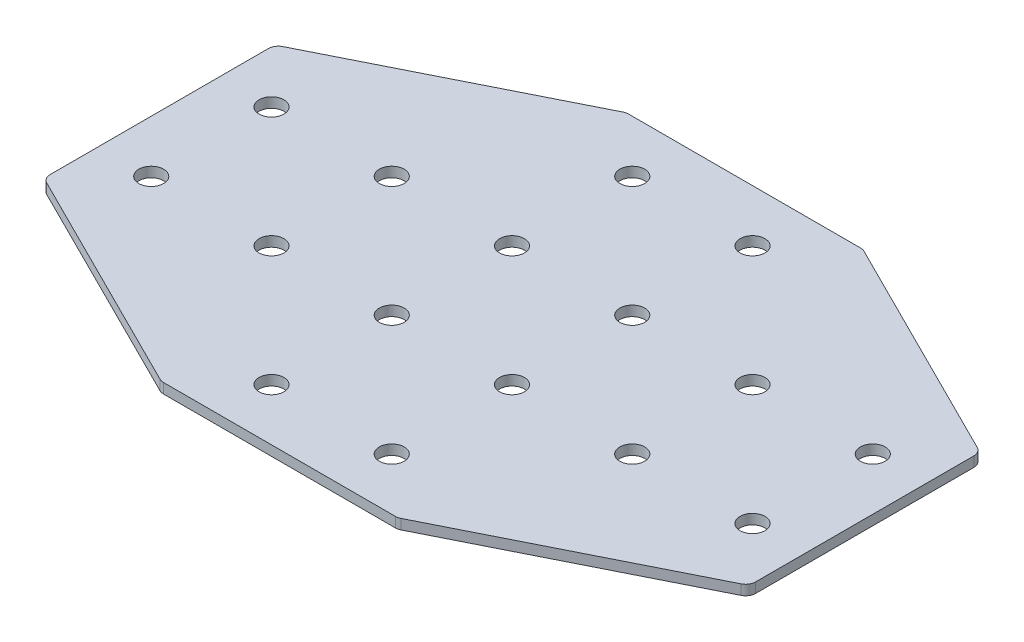
ISO-10303-21;
HEADER;
FILE_DESCRIPTION(('STEP AP214'),'2;1');
FILE_NAME('part.step','',(''),(''),'','','');
FILE_SCHEMA(('AUTOMOTIVE_DESIGN { 1 0 10303 214 1 1 1 1 }'));
ENDSEC;
DATA;
#1=APPLICATION_CONTEXT('core data for automotive mechanical design processes');
#2=APPLICATION_PROTOCOL_DEFINITION('international standard','automotive_design',2000,#1);
#3=PRODUCT_CONTEXT('',#1,'mechanical');
#4=PRODUCT('Part','Part','',(#3));
#5=PRODUCT_RELATED_PRODUCT_CATEGORY('part','',(#4));
#6=PRODUCT_DEFINITION_FORMATION('','',#4);
#7=PRODUCT_DEFINITION_CONTEXT('part definition',#1,'design');
#8=PRODUCT_DEFINITION('design','',#6,#7);
#9=PRODUCT_DEFINITION_SHAPE('','',#8);
#10=(LENGTH_UNIT() NAMED_UNIT(*) SI_UNIT(.MILLI.,.METRE.));
#11=(NAMED_UNIT(*) PLANE_ANGLE_UNIT() SI_UNIT($,.RADIAN.));
#12=(NAMED_UNIT(*) SI_UNIT($,.STERADIAN.) SOLID_ANGLE_UNIT());
#13=UNCERTAINTY_MEASURE_WITH_UNIT(LENGTH_MEASURE(1.E-05),#10,'distance_accuracy_value','');
#14=(GEOMETRIC_REPRESENTATION_CONTEXT(3) GLOBAL_UNCERTAINTY_ASSIGNED_CONTEXT((#13)) GLOBAL_UNIT_ASSIGNED_CONTEXT((#10,
#11,#12)) REPRESENTATION_CONTEXT('',''));
#15=CARTESIAN_POINT('',(0.,0.,0.));
#16=DIRECTION('',(0.,0.,1.));
#17=DIRECTION('',(1.,0.,0.));
#18=AXIS2_PLACEMENT_3D('',#15,#16,#17);
#19=CARTESIAN_POINT('',(-1.3162117550678,0.80807034319605,-0.741524121224302));
#20=DIRECTION('',(0.,-1.,0.));
#21=DIRECTION('',(0.,0.,-1.));
#22=AXIS2_PLACEMENT_3D('',#19,#20,#21);
#23=PLANE('',#22);
#24=CARTESIAN_POINT('',(-16.3162117550678,0.80807034319605,14.2584758787757));
#25=DIRECTION('',(0.,-1.,0.));
#26=DIRECTION('',(0.,0.,1.));
#27=AXIS2_PLACEMENT_3D('',#24,#25,#26);
#28=CIRCLE('',#27,3.1);
#29=CARTESIAN_POINT('',(-16.3162117550678,0.80807034319605,17.3584758787757));
#30=VERTEX_POINT('',#29);
#31=EDGE_CURVE('E140',#30,#30,#28,.T.);
#32=ORIENTED_EDGE('',*,*,#31,.F.);
#33=EDGE_LOOP('',(#32));
#34=FACE_BOUND('',#33,.T.);
#35=CARTESIAN_POINT('',(-16.3162117550678,0.80807034319605,44.2584758787757));
#36=DIRECTION('',(0.,-1.,0.));
#37=DIRECTION('',(0.,0.,1.));
#38=AXIS2_PLACEMENT_3D('',#35,#36,#37);
#39=CIRCLE('',#38,3.1);
#40=CARTESIAN_POINT('',(-16.3162117550678,0.80807034319605,47.3584758787757));
#41=VERTEX_POINT('',#40);
#42=EDGE_CURVE('E243',#41,#41,#39,.T.);
#43=ORIENTED_EDGE('',*,*,#42,.F.);
#44=EDGE_LOOP('',(#43));
#45=FACE_BOUND('',#44,.T.);
#46=CARTESIAN_POINT('',(-46.3162117550678,0.80807034319605,14.2584758787757));
#47=DIRECTION('',(0.,-1.,0.));
#48=DIRECTION('',(0.,0.,1.));
#49=AXIS2_PLACEMENT_3D('',#46,#47,#48);
#50=CIRCLE('',#49,3.1);
#51=CARTESIAN_POINT('',(-46.3162117550678,0.80807034319605,17.3584758787757));
#52=VERTEX_POINT('',#51);
#53=EDGE_CURVE('E237',#52,#52,#50,.T.);
#54=ORIENTED_EDGE('',*,*,#53,.F.);
#55=EDGE_LOOP('',(#54));
#56=FACE_BOUND('',#55,.T.);
#57=CARTESIAN_POINT('',(-76.3162117550678,0.80807034319605,14.2584758787757));
#58=DIRECTION('',(0.,-1.,0.));
#59=DIRECTION('',(0.,0.,1.));
#60=AXIS2_PLACEMENT_3D('',#57,#58,#59);
#61=CIRCLE('',#60,3.1);
#62=CARTESIAN_POINT('',(-76.3162117550678,0.80807034319605,17.3584758787757));
#63=VERTEX_POINT('',#62);
#64=EDGE_CURVE('E231',#63,#63,#61,.T.);
#65=ORIENTED_EDGE('',*,*,#64,.F.);
#66=EDGE_LOOP('',(#65));
#67=FACE_BOUND('',#66,.T.);
#68=CARTESIAN_POINT('',(13.6837882449322,0.80807034319605,14.2584758787757));
#69=DIRECTION('',(0.,1.,0.));
#70=DIRECTION('',(0.,0.,1.));
#71=AXIS2_PLACEMENT_3D('',#68,#69,#70);
#72=CIRCLE('',#71,3.1);
#73=CARTESIAN_POINT('',(13.6837882449322,0.80807034319605,17.3584758787757));
#74=VERTEX_POINT('',#73);
#75=EDGE_CURVE('E298',#74,#74,#72,.T.);
#76=ORIENTED_EDGE('',*,*,#75,.T.);
#77=EDGE_LOOP('',(#76));
#78=FACE_BOUND('',#77,.T.);
#79=CARTESIAN_POINT('',(13.6837882449322,0.80807034319605,44.2584758787757));
#80=DIRECTION('',(0.,1.,0.));
#81=DIRECTION('',(0.,0.,1.));
#82=AXIS2_PLACEMENT_3D('',#79,#80,#81);
#83=CIRCLE('',#82,3.1);
#84=CARTESIAN_POINT('',(13.6837882449322,0.80807034319605,47.3584758787757));
#85=VERTEX_POINT('',#84);
#86=EDGE_CURVE('E292',#85,#85,#83,.T.);
#87=ORIENTED_EDGE('',*,*,#86,.T.);
#88=EDGE_LOOP('',(#87));
#89=FACE_BOUND('',#88,.T.);
#90=CARTESIAN_POINT('',(43.6837882449322,0.80807034319605,14.2584758787757));
#91=DIRECTION('',(0.,1.,0.));
#92=DIRECTION('',(0.,0.,1.));
#93=AXIS2_PLACEMENT_3D('',#90,#91,#92);
#94=CIRCLE('',#93,3.1);
#95=CARTESIAN_POINT('',(43.6837882449322,0.80807034319605,17.3584758787757));
#96=VERTEX_POINT('',#95);
#97=EDGE_CURVE('E286',#96,#96,#94,.T.);
#98=ORIENTED_EDGE('',*,*,#97,.T.);
#99=EDGE_LOOP('',(#98));
#100=FACE_BOUND('',#99,.T.);
#101=CARTESIAN_POINT('',(73.6837882449322,0.80807034319605,14.2584758787757));
#102=DIRECTION('',(0.,1.,0.));
#103=DIRECTION('',(0.,0.,1.));
#104=AXIS2_PLACEMENT_3D('',#101,#102,#103);
#105=CIRCLE('',#104,3.1);
#106=CARTESIAN_POINT('',(73.6837882449322,0.80807034319605,17.3584758787757));
#107=VERTEX_POINT('',#106);
#108=EDGE_CURVE('E280',#107,#107,#105,.T.);
#109=ORIENTED_EDGE('',*,*,#108,.T.);
#110=EDGE_LOOP('',(#109));
#111=FACE_BOUND('',#110,.T.);
#112=DIRECTION('',(0.,0.,-1.));
#113=VECTOR('',#112,1.);
#114=CARTESIAN_POINT('',(-89.3162117550677,0.80807034319605,28.022407901276));
#115=LINE('',#114,#113);
#116=CARTESIAN_POINT('',(-89.3162117550677,0.80807034319605,26.4773229294012));
#117=VERTEX_POINT('',#116);
#118=CARTESIAN_POINT('',(-89.3162117550677,0.80807034319605,-27.9603711718498));
#119=VERTEX_POINT('',#118);
#120=EDGE_CURVE('E253',#117,#119,#115,.T.);
#121=ORIENTED_EDGE('',*,*,#120,.T.);
#122=CARTESIAN_POINT('',(-86.8162117550677,0.80807034319605,-27.9603711718498));
#123=DIRECTION('',(0.,-1.,0.));
#124=DIRECTION('',(0.,0.,1.));
#125=AXIS2_PLACEMENT_3D('',#122,#123,#124);
#126=CIRCLE('',#125,2.5);
#127=CARTESIAN_POINT('',(-87.9342457438176,0.80807034319605,-30.1964391493496));
#128=VERTEX_POINT('',#127);
#129=EDGE_CURVE('E148',#119,#128,#126,.T.);
#130=ORIENTED_EDGE('',*,*,#129,.T.);
#131=DIRECTION('',(-0.894427190999916,0.,0.447213595499958));
#132=VECTOR('',#131,1.);
#133=CARTESIAN_POINT('',(-30.8440758000683,0.80807034319605,-58.7415241212243));
#134=LINE('',#133,#132);
#135=CARTESIAN_POINT('',(-31.3719398450687,0.80807034319605,-58.4775920987241));
#136=VERTEX_POINT('',#135);
#137=EDGE_CURVE('E158',#136,#128,#134,.T.);
#138=ORIENTED_EDGE('',*,*,#137,.F.);
#139=CARTESIAN_POINT('',(-30.2539058563188,0.80807034319605,-56.2415241212243));
#140=DIRECTION('',(0.,-1.,0.));
#141=DIRECTION('',(0.,0.,1.));
#142=AXIS2_PLACEMENT_3D('',#139,#140,#141);
#143=CIRCLE('',#142,2.5);
#144=CARTESIAN_POINT('',(-30.2539058563188,0.80807034319605,-58.7415241212243));
#145=VERTEX_POINT('',#144);
#146=EDGE_CURVE('E168',#136,#145,#143,.T.);
#147=ORIENTED_EDGE('',*,*,#146,.T.);
#148=DIRECTION('',(1.,0.,0.));
#149=VECTOR('',#148,1.);
#150=CARTESIAN_POINT('',(-29.3162117550679,0.80807034319605,-58.7415241212243));
#151=LINE('',#150,#149);
#152=CARTESIAN_POINT('',(27.6214823461832,0.80807034319605,-58.7415241212243));
#153=VERTEX_POINT('',#152);
#154=EDGE_CURVE('E198',#145,#153,#151,.T.);
#155=ORIENTED_EDGE('',*,*,#154,.T.);
#156=CARTESIAN_POINT('',(27.6214823461833,0.80807034319605,-56.2415241212243));
#157=DIRECTION('',(0.,1.,0.));
#158=DIRECTION('',(0.,0.,1.));
#159=AXIS2_PLACEMENT_3D('',#156,#157,#158);
#160=CIRCLE('',#159,2.5);
#161=CARTESIAN_POINT('',(28.7395163349331,0.80807034319605,-58.4775920987241));
#162=VERTEX_POINT('',#161);
#163=EDGE_CURVE('E220',#162,#153,#160,.T.);
#164=ORIENTED_EDGE('',*,*,#163,.F.);
#165=DIRECTION('',(0.894427190999916,0.,0.447213595499958));
#166=VECTOR('',#165,1.);
#167=CARTESIAN_POINT('',(28.2116522899327,0.80807034319605,-58.7415241212243));
#168=LINE('',#167,#166);
#169=CARTESIAN_POINT('',(85.301822233682,0.80807034319605,-30.1964391493496));
#170=VERTEX_POINT('',#169);
#171=EDGE_CURVE('E201',#162,#170,#168,.T.);
#172=ORIENTED_EDGE('',*,*,#171,.T.);
#173=CARTESIAN_POINT('',(84.1837882449321,0.80807034319605,-27.9603711718498));
#174=DIRECTION('',(0.,1.,0.));
#175=DIRECTION('',(0.,0.,1.));
#176=AXIS2_PLACEMENT_3D('',#173,#174,#175);
#177=CIRCLE('',#176,2.5);
#178=CARTESIAN_POINT('',(86.6837882449321,0.80807034319605,-27.9603711718498));
#179=VERTEX_POINT('',#178);
#180=EDGE_CURVE('E217',#179,#170,#177,.T.);
#181=ORIENTED_EDGE('',*,*,#180,.F.);
#182=DIRECTION('',(0.,0.,-1.));
#183=VECTOR('',#182,1.);
#184=CARTESIAN_POINT('',(86.6837882449321,0.80807034319605,28.0224079012759));
#185=LINE('',#184,#183);
#186=CARTESIAN_POINT('',(86.6837882449321,0.80807034319605,26.4773229294012));
#187=VERTEX_POINT('',#186);
#188=EDGE_CURVE('E304',#187,#179,#185,.T.);
#189=ORIENTED_EDGE('',*,*,#188,.F.);
#190=CARTESIAN_POINT('',(84.1837882449321,0.80807034319605,26.4773229294012));
#191=DIRECTION('',(0.,-1.,0.));
#192=DIRECTION('',(0.,0.,-1.));
#193=AXIS2_PLACEMENT_3D('',#190,#191,#192);
#194=CIRCLE('',#193,2.5);
#195=CARTESIAN_POINT('',(85.301822233682,0.80807034319605,28.713390906901));
#196=VERTEX_POINT('',#195);
#197=EDGE_CURVE('E31',#187,#196,#194,.T.);
#198=ORIENTED_EDGE('',*,*,#197,.T.);
#199=DIRECTION('',(0.894427190999916,0.,-0.447213595499958));
#200=VECTOR('',#199,1.);
#201=CARTESIAN_POINT('',(28.2116522899327,0.80807034319605,57.2584758787757));
#202=LINE('',#201,#200);
#203=CARTESIAN_POINT('',(28.7395163349331,0.80807034319605,56.9945438562755));
#204=VERTEX_POINT('',#203);
#205=EDGE_CURVE('E309',#204,#196,#202,.T.);
#206=ORIENTED_EDGE('',*,*,#205,.F.);
#207=CARTESIAN_POINT('',(27.6214823461833,0.80807034319605,54.7584758787757));
#208=DIRECTION('',(0.,-1.,0.));
#209=DIRECTION('',(0.,0.,-1.));
#210=AXIS2_PLACEMENT_3D('',#207,#208,#209);
#211=CIRCLE('',#210,2.5);
#212=CARTESIAN_POINT('',(27.6214823461832,0.80807034319605,57.2584758787757));
#213=VERTEX_POINT('',#212);
#214=EDGE_CURVE('E324',#204,#213,#211,.T.);
#215=ORIENTED_EDGE('',*,*,#214,.T.);
#216=DIRECTION('',(1.,0.,0.));
#217=VECTOR('',#216,1.);
#218=CARTESIAN_POINT('',(-29.3162117550679,0.80807034319605,57.2584758787757));
#219=LINE('',#218,#217);
#220=CARTESIAN_POINT('',(-30.2539058563188,0.80807034319605,57.2584758787757));
#221=VERTEX_POINT('',#220);
#222=EDGE_CURVE('E306',#221,#213,#219,.T.);
#223=ORIENTED_EDGE('',*,*,#222,.F.);
#224=CARTESIAN_POINT('',(-30.2539058563188,0.80807034319605,54.7584758787757));
#225=DIRECTION('',(0.,1.,0.));
#226=DIRECTION('',(0.,0.,-1.));
#227=AXIS2_PLACEMENT_3D('',#224,#225,#226);
#228=CIRCLE('',#227,2.5);
#229=CARTESIAN_POINT('',(-31.3719398450687,0.80807034319605,56.9945438562755));
#230=VERTEX_POINT('',#229);
#231=EDGE_CURVE('E270',#230,#221,#228,.T.);
#232=ORIENTED_EDGE('',*,*,#231,.F.);
#233=DIRECTION('',(-0.894427190999916,0.,-0.447213595499958));
#234=VECTOR('',#233,1.);
#235=CARTESIAN_POINT('',(-30.8440758000683,0.80807034319605,57.2584758787757));
#236=LINE('',#235,#234);
#237=CARTESIAN_POINT('',(-87.9342457438176,0.80807034319605,28.713390906901));
#238=VERTEX_POINT('',#237);
#239=EDGE_CURVE('E255',#230,#238,#236,.T.);
#240=ORIENTED_EDGE('',*,*,#239,.T.);
#241=CARTESIAN_POINT('',(-86.8162117550677,0.80807034319605,26.4773229294012));
#242=DIRECTION('',(0.,1.,0.));
#243=DIRECTION('',(0.,0.,-1.));
#244=AXIS2_PLACEMENT_3D('',#241,#242,#243);
#245=CIRCLE('',#244,2.5);
#246=EDGE_CURVE('E267',#117,#238,#245,.T.);
#247=ORIENTED_EDGE('',*,*,#246,.F.);
#248=EDGE_LOOP('',(#121,#130,#138,#147,#155,#164,#172,#181,#189,#198,#206,#215,#223,#232,#240,#247));
#249=FACE_BOUND('',#248,.T.);
#250=CARTESIAN_POINT('',(-16.3162117550678,0.80807034319605,-15.7415241212243));
#251=DIRECTION('',(0.,1.,0.));
#252=DIRECTION('',(0.,0.,-1.));
#253=AXIS2_PLACEMENT_3D('',#250,#251,#252);
#254=CIRCLE('',#253,3.1);
#255=CARTESIAN_POINT('',(-16.3162117550678,0.80807034319605,-18.8415241212243));
#256=VERTEX_POINT('',#255);
#257=EDGE_CURVE('E352',#256,#256,#254,.T.);
#258=ORIENTED_EDGE('',*,*,#257,.T.);
#259=EDGE_LOOP('',(#258));
#260=FACE_BOUND('',#259,.T.);
#261=CARTESIAN_POINT('',(-16.3162117550678,0.80807034319605,-45.7415241212243));
#262=DIRECTION('',(0.,1.,0.));
#263=DIRECTION('',(0.,0.,-1.));
#264=AXIS2_PLACEMENT_3D('',#261,#262,#263);
#265=CIRCLE('',#264,3.1);
#266=CARTESIAN_POINT('',(-16.3162117550678,0.80807034319605,-48.8415241212243));
#267=VERTEX_POINT('',#266);
#268=EDGE_CURVE('E356',#267,#267,#265,.T.);
#269=ORIENTED_EDGE('',*,*,#268,.T.);
#270=EDGE_LOOP('',(#269));
#271=FACE_BOUND('',#270,.T.);
#272=CARTESIAN_POINT('',(-46.3162117550678,0.80807034319605,-15.7415241212243));
#273=DIRECTION('',(0.,1.,0.));
#274=DIRECTION('',(0.,0.,-1.));
#275=AXIS2_PLACEMENT_3D('',#272,#273,#274);
#276=CIRCLE('',#275,3.1);
#277=CARTESIAN_POINT('',(-46.3162117550678,0.80807034319605,-18.8415241212243));
#278=VERTEX_POINT('',#277);
#279=EDGE_CURVE('E360',#278,#278,#276,.T.);
#280=ORIENTED_EDGE('',*,*,#279,.T.);
#281=EDGE_LOOP('',(#280));
#282=FACE_BOUND('',#281,.T.);
#283=CARTESIAN_POINT('',(-76.3162117550678,0.80807034319605,-15.7415241212243));
#284=DIRECTION('',(0.,1.,0.));
#285=DIRECTION('',(0.,0.,-1.));
#286=AXIS2_PLACEMENT_3D('',#283,#284,#285);
#287=CIRCLE('',#286,3.1);
#288=CARTESIAN_POINT('',(-76.3162117550678,0.80807034319605,-18.8415241212243));
#289=VERTEX_POINT('',#288);
#290=EDGE_CURVE('E364',#289,#289,#287,.T.);
#291=ORIENTED_EDGE('',*,*,#290,.T.);
#292=EDGE_LOOP('',(#291));
#293=FACE_BOUND('',#292,.T.);
#294=CARTESIAN_POINT('',(13.6837882449322,0.80807034319605,-15.7415241212243));
#295=DIRECTION('',(0.,-1.,0.));
#296=DIRECTION('',(0.,0.,-1.));
#297=AXIS2_PLACEMENT_3D('',#294,#295,#296);
#298=CIRCLE('',#297,3.1);
#299=CARTESIAN_POINT('',(13.6837882449322,0.80807034319605,-18.8415241212243));
#300=VERTEX_POINT('',#299);
#301=EDGE_CURVE('E192',#300,#300,#298,.T.);
#302=ORIENTED_EDGE('',*,*,#301,.F.);
#303=EDGE_LOOP('',(#302));
#304=FACE_BOUND('',#303,.T.);
#305=CARTESIAN_POINT('',(13.6837882449322,0.80807034319605,-45.7415241212243));
#306=DIRECTION('',(0.,-1.,0.));
#307=DIRECTION('',(0.,0.,-1.));
#308=AXIS2_PLACEMENT_3D('',#305,#306,#307);
#309=CIRCLE('',#308,3.1);
#310=CARTESIAN_POINT('',(13.6837882449322,0.80807034319605,-48.8415241212243));
#311=VERTEX_POINT('',#310);
#312=EDGE_CURVE('E186',#311,#311,#309,.T.);
#313=ORIENTED_EDGE('',*,*,#312,.F.);
#314=EDGE_LOOP('',(#313));
#315=FACE_BOUND('',#314,.T.);
#316=CARTESIAN_POINT('',(43.6837882449322,0.80807034319605,-15.7415241212243));
#317=DIRECTION('',(0.,-1.,0.));
#318=DIRECTION('',(0.,0.,-1.));
#319=AXIS2_PLACEMENT_3D('',#316,#317,#318);
#320=CIRCLE('',#319,3.1);
#321=CARTESIAN_POINT('',(43.6837882449322,0.80807034319605,-18.8415241212243));
#322=VERTEX_POINT('',#321);
#323=EDGE_CURVE('E180',#322,#322,#320,.T.);
#324=ORIENTED_EDGE('',*,*,#323,.F.);
#325=EDGE_LOOP('',(#324));
#326=FACE_BOUND('',#325,.T.);
#327=CARTESIAN_POINT('',(73.6837882449322,0.80807034319605,-15.7415241212243));
#328=DIRECTION('',(0.,-1.,0.));
#329=DIRECTION('',(0.,0.,-1.));
#330=AXIS2_PLACEMENT_3D('',#327,#328,#329);
#331=CIRCLE('',#330,3.1);
#332=CARTESIAN_POINT('',(73.6837882449322,0.80807034319605,-18.8415241212243));
#333=VERTEX_POINT('',#332);
#334=EDGE_CURVE('E174',#333,#333,#331,.T.);
#335=ORIENTED_EDGE('',*,*,#334,.F.);
#336=EDGE_LOOP('',(#335));
#337=FACE_BOUND('',#336,.T.);
#338=ADVANCED_FACE('F16',(#34,#45,#56,#67,#78,#89,#100,#111,#249,#260,#271,#282,#293,#304,#315,
#326,#337),#23,.T.);
#339=CARTESIAN_POINT('',(86.6837882449321,0.80807034319605,28.0224079012759));
#340=DIRECTION('',(1.,0.,0.));
#341=DIRECTION('',(0.,0.,-1.));
#342=AXIS2_PLACEMENT_3D('',#339,#340,#341);
#343=PLANE('',#342);
#344=ORIENTED_EDGE('',*,*,#188,.T.);
#345=DIRECTION('',(0.,1.,0.));
#346=VECTOR('',#345,1.);
#347=CARTESIAN_POINT('',(86.6837882449321,0.80807034319605,-27.9603711718498));
#348=LINE('',#347,#346);
#349=CARTESIAN_POINT('',(86.6837882449321,3.30807034319605,-27.9603711718498));
#350=VERTEX_POINT('',#349);
#351=EDGE_CURVE('E227',#350,#179,#348,.F.);
#352=ORIENTED_EDGE('',*,*,#351,.F.);
#353=DIRECTION('',(0.,0.,-1.));
#354=VECTOR('',#353,1.);
#355=CARTESIAN_POINT('',(86.6837882449321,3.30807034319605,28.0224079012759));
#356=LINE('',#355,#354);
#357=CARTESIAN_POINT('',(86.6837882449321,3.30807034319605,26.4773229294012));
#358=VERTEX_POINT('',#357);
#359=EDGE_CURVE('E301',#358,#350,#356,.T.);
#360=ORIENTED_EDGE('',*,*,#359,.F.);
#361=DIRECTION('',(0.,1.,0.));
#362=VECTOR('',#361,1.);
#363=CARTESIAN_POINT('',(86.6837882449321,0.80807034319605,26.4773229294012));
#364=LINE('',#363,#362);
#365=EDGE_CURVE('E10',#358,#187,#364,.F.);
#366=ORIENTED_EDGE('',*,*,#365,.T.);
#367=EDGE_LOOP('',(#344,#352,#360,#366));
#368=FACE_BOUND('',#367,.T.);
#369=ADVANCED_FACE('F346',(#368),#343,.T.);
#370=CARTESIAN_POINT('',(-1.3162117550678,3.30807034319605,-0.741524121224302));
#371=DIRECTION('',(0.,-1.,0.));
#372=DIRECTION('',(0.,0.,-1.));
#373=AXIS2_PLACEMENT_3D('',#370,#371,#372);
#374=PLANE('',#373);
#375=CARTESIAN_POINT('',(-16.3162117550678,3.30807034319605,14.2584758787757));
#376=DIRECTION('',(0.,-1.,0.));
#377=DIRECTION('',(0.,0.,1.));
#378=AXIS2_PLACEMENT_3D('',#375,#376,#377);
#379=CIRCLE('',#378,3.1);
#380=CARTESIAN_POINT('',(-16.3162117550678,3.30807034319605,17.3584758787757));
#381=VERTEX_POINT('',#380);
#382=EDGE_CURVE('E246',#381,#381,#379,.T.);
#383=ORIENTED_EDGE('',*,*,#382,.T.);
#384=EDGE_LOOP('',(#383));
#385=FACE_BOUND('',#384,.T.);
#386=CARTESIAN_POINT('',(-16.3162117550678,3.30807034319605,44.2584758787757));
#387=DIRECTION('',(0.,-1.,0.));
#388=DIRECTION('',(0.,0.,1.));
#389=AXIS2_PLACEMENT_3D('',#386,#387,#388);
#390=CIRCLE('',#389,3.1);
#391=CARTESIAN_POINT('',(-16.3162117550678,3.30807034319605,47.3584758787757));
#392=VERTEX_POINT('',#391);
#393=EDGE_CURVE('E240',#392,#392,#390,.T.);
#394=ORIENTED_EDGE('',*,*,#393,.T.);
#395=EDGE_LOOP('',(#394));
#396=FACE_BOUND('',#395,.T.);
#397=CARTESIAN_POINT('',(-46.3162117550678,3.30807034319605,14.2584758787757));
#398=DIRECTION('',(0.,-1.,0.));
#399=DIRECTION('',(0.,0.,1.));
#400=AXIS2_PLACEMENT_3D('',#397,#398,#399);
#401=CIRCLE('',#400,3.1);
#402=CARTESIAN_POINT('',(-46.3162117550678,3.30807034319605,17.3584758787757));
#403=VERTEX_POINT('',#402);
#404=EDGE_CURVE('E234',#403,#403,#401,.T.);
#405=ORIENTED_EDGE('',*,*,#404,.T.);
#406=EDGE_LOOP('',(#405));
#407=FACE_BOUND('',#406,.T.);
#408=CARTESIAN_POINT('',(-76.3162117550678,3.30807034319605,14.2584758787757));
#409=DIRECTION('',(0.,-1.,0.));
#410=DIRECTION('',(0.,0.,1.));
#411=AXIS2_PLACEMENT_3D('',#408,#409,#410);
#412=CIRCLE('',#411,3.1);
#413=CARTESIAN_POINT('',(-76.3162117550678,3.30807034319605,17.3584758787757));
#414=VERTEX_POINT('',#413);
#415=EDGE_CURVE('E230',#414,#414,#412,.T.);
#416=ORIENTED_EDGE('',*,*,#415,.T.);
#417=EDGE_LOOP('',(#416));
#418=FACE_BOUND('',#417,.T.);
#419=CARTESIAN_POINT('',(13.6837882449322,3.30807034319605,14.2584758787757));
#420=DIRECTION('',(0.,1.,0.));
#421=DIRECTION('',(0.,0.,1.));
#422=AXIS2_PLACEMENT_3D('',#419,#420,#421);
#423=CIRCLE('',#422,3.1);
#424=CARTESIAN_POINT('',(13.6837882449322,3.30807034319605,17.3584758787757));
#425=VERTEX_POINT('',#424);
#426=EDGE_CURVE('E295',#425,#425,#423,.T.);
#427=ORIENTED_EDGE('',*,*,#426,.F.);
#428=EDGE_LOOP('',(#427));
#429=FACE_BOUND('',#428,.T.);
#430=CARTESIAN_POINT('',(13.6837882449322,3.30807034319605,44.2584758787757));
#431=DIRECTION('',(0.,1.,0.));
#432=DIRECTION('',(0.,0.,1.));
#433=AXIS2_PLACEMENT_3D('',#430,#431,#432);
#434=CIRCLE('',#433,3.1);
#435=CARTESIAN_POINT('',(13.6837882449322,3.30807034319605,47.3584758787757));
#436=VERTEX_POINT('',#435);
#437=EDGE_CURVE('E289',#436,#436,#434,.T.);
#438=ORIENTED_EDGE('',*,*,#437,.F.);
#439=EDGE_LOOP('',(#438));
#440=FACE_BOUND('',#439,.T.);
#441=CARTESIAN_POINT('',(43.6837882449322,3.30807034319605,14.2584758787757));
#442=DIRECTION('',(0.,1.,0.));
#443=DIRECTION('',(0.,0.,1.));
#444=AXIS2_PLACEMENT_3D('',#441,#442,#443);
#445=CIRCLE('',#444,3.1);
#446=CARTESIAN_POINT('',(43.6837882449322,3.30807034319605,17.3584758787757));
#447=VERTEX_POINT('',#446);
#448=EDGE_CURVE('E283',#447,#447,#445,.T.);
#449=ORIENTED_EDGE('',*,*,#448,.F.);
#450=EDGE_LOOP('',(#449));
#451=FACE_BOUND('',#450,.T.);
#452=CARTESIAN_POINT('',(73.6837882449322,3.30807034319605,14.2584758787757));
#453=DIRECTION('',(0.,1.,0.));
#454=DIRECTION('',(0.,0.,1.));
#455=AXIS2_PLACEMENT_3D('',#452,#453,#454);
#456=CIRCLE('',#455,3.1);
#457=CARTESIAN_POINT('',(73.6837882449322,3.30807034319605,17.3584758787757));
#458=VERTEX_POINT('',#457);
#459=EDGE_CURVE('E279',#458,#458,#456,.T.);
#460=ORIENTED_EDGE('',*,*,#459,.F.);
#461=EDGE_LOOP('',(#460));
#462=FACE_BOUND('',#461,.T.);
#463=ORIENTED_EDGE('',*,*,#359,.T.);
#464=CARTESIAN_POINT('',(84.1837882449321,3.30807034319605,-27.9603711718498));
#465=DIRECTION('',(0.,1.,0.));
#466=DIRECTION('',(0.,0.,1.));
#467=AXIS2_PLACEMENT_3D('',#464,#465,#466);
#468=CIRCLE('',#467,2.5);
#469=CARTESIAN_POINT('',(85.301822233682,3.30807034319605,-30.1964391493496));
#470=VERTEX_POINT('',#469);
#471=EDGE_CURVE('E205',#470,#350,#468,.F.);
#472=ORIENTED_EDGE('',*,*,#471,.F.);
#473=DIRECTION('',(0.894427190999916,0.,0.447213595499958));
#474=VECTOR('',#473,1.);
#475=CARTESIAN_POINT('',(28.2116522899327,3.30807034319605,-58.7415241212243));
#476=LINE('',#475,#474);
#477=CARTESIAN_POINT('',(28.7395163349331,3.30807034319605,-58.4775920987241));
#478=VERTEX_POINT('',#477);
#479=EDGE_CURVE('E202',#478,#470,#476,.T.);
#480=ORIENTED_EDGE('',*,*,#479,.F.);
#481=CARTESIAN_POINT('',(27.6214823461833,3.30807034319605,-56.2415241212243));
#482=DIRECTION('',(0.,1.,0.));
#483=DIRECTION('',(0.,0.,1.));
#484=AXIS2_PLACEMENT_3D('',#481,#482,#483);
#485=CIRCLE('',#484,2.5);
#486=CARTESIAN_POINT('',(27.6214823461832,3.30807034319605,-58.7415241212243));
#487=VERTEX_POINT('',#486);
#488=EDGE_CURVE('E212',#487,#478,#485,.F.);
#489=ORIENTED_EDGE('',*,*,#488,.F.);
#490=DIRECTION('',(1.,0.,0.));
#491=VECTOR('',#490,1.);
#492=CARTESIAN_POINT('',(-29.3162117550679,3.30807034319605,-58.7415241212243));
#493=LINE('',#492,#491);
#494=CARTESIAN_POINT('',(-30.2539058563188,3.30807034319605,-58.7415241212243));
#495=VERTEX_POINT('',#494);
#496=EDGE_CURVE('E195',#495,#487,#493,.T.);
#497=ORIENTED_EDGE('',*,*,#496,.F.);
#498=CARTESIAN_POINT('',(-30.2539058563188,3.30807034319605,-56.2415241212243));
#499=DIRECTION('',(0.,-1.,0.));
#500=DIRECTION('',(0.,0.,1.));
#501=AXIS2_PLACEMENT_3D('',#498,#499,#500);
#502=CIRCLE('',#501,2.5);
#503=CARTESIAN_POINT('',(-31.3719398450687,3.30807034319605,-58.4775920987241));
#504=VERTEX_POINT('',#503);
#505=EDGE_CURVE('E157',#495,#504,#502,.F.);
#506=ORIENTED_EDGE('',*,*,#505,.T.);
#507=DIRECTION('',(-0.894427190999916,0.,0.447213595499958));
#508=VECTOR('',#507,1.);
#509=CARTESIAN_POINT('',(-30.8440758000683,3.30807034319605,-58.7415241212243));
#510=LINE('',#509,#508);
#511=CARTESIAN_POINT('',(-87.9342457438176,3.30807034319605,-30.1964391493496));
#512=VERTEX_POINT('',#511);
#513=EDGE_CURVE('E156',#504,#512,#510,.T.);
#514=ORIENTED_EDGE('',*,*,#513,.T.);
#515=CARTESIAN_POINT('',(-86.8162117550677,3.30807034319605,-27.9603711718498));
#516=DIRECTION('',(0.,-1.,0.));
#517=DIRECTION('',(0.,0.,1.));
#518=AXIS2_PLACEMENT_3D('',#515,#516,#517);
#519=CIRCLE('',#518,2.5);
#520=CARTESIAN_POINT('',(-89.3162117550677,3.30807034319605,-27.9603711718498));
#521=VERTEX_POINT('',#520);
#522=EDGE_CURVE('E145',#512,#521,#519,.F.);
#523=ORIENTED_EDGE('',*,*,#522,.T.);
#524=DIRECTION('',(0.,0.,-1.));
#525=VECTOR('',#524,1.);
#526=CARTESIAN_POINT('',(-89.3162117550677,3.30807034319605,28.022407901276));
#527=LINE('',#526,#525);
#528=CARTESIAN_POINT('',(-89.3162117550677,3.30807034319605,26.4773229294012));
#529=VERTEX_POINT('',#528);
#530=EDGE_CURVE('E130',#529,#521,#527,.T.);
#531=ORIENTED_EDGE('',*,*,#530,.F.);
#532=CARTESIAN_POINT('',(-86.8162117550677,3.30807034319605,26.4773229294012));
#533=DIRECTION('',(0.,1.,0.));
#534=DIRECTION('',(0.,0.,-1.));
#535=AXIS2_PLACEMENT_3D('',#532,#533,#534);
#536=CIRCLE('',#535,2.5);
#537=CARTESIAN_POINT('',(-87.9342457438176,3.30807034319605,28.713390906901));
#538=VERTEX_POINT('',#537);
#539=EDGE_CURVE('E257',#538,#529,#536,.F.);
#540=ORIENTED_EDGE('',*,*,#539,.F.);
#541=DIRECTION('',(-0.894427190999916,0.,-0.447213595499958));
#542=VECTOR('',#541,1.);
#543=CARTESIAN_POINT('',(-30.8440758000683,3.30807034319605,57.2584758787757));
#544=LINE('',#543,#542);
#545=CARTESIAN_POINT('',(-31.3719398450687,3.30807034319605,56.9945438562755));
#546=VERTEX_POINT('',#545);
#547=EDGE_CURVE('E139',#546,#538,#544,.T.);
#548=ORIENTED_EDGE('',*,*,#547,.F.);
#549=CARTESIAN_POINT('',(-30.2539058563188,3.30807034319605,54.7584758787757));
#550=DIRECTION('',(0.,1.,0.));
#551=DIRECTION('',(0.,0.,-1.));
#552=AXIS2_PLACEMENT_3D('',#549,#550,#551);
#553=CIRCLE('',#552,2.5);
#554=CARTESIAN_POINT('',(-30.2539058563188,3.30807034319605,57.2584758787757));
#555=VERTEX_POINT('',#554);
#556=EDGE_CURVE('E262',#555,#546,#553,.F.);
#557=ORIENTED_EDGE('',*,*,#556,.F.);
#558=DIRECTION('',(1.,0.,0.));
#559=VECTOR('',#558,1.);
#560=CARTESIAN_POINT('',(-29.3162117550679,3.30807034319605,57.2584758787757));
#561=LINE('',#560,#559);
#562=CARTESIAN_POINT('',(27.6214823461832,3.30807034319605,57.2584758787757));
#563=VERTEX_POINT('',#562);
#564=EDGE_CURVE('E313',#555,#563,#561,.T.);
#565=ORIENTED_EDGE('',*,*,#564,.T.);
#566=CARTESIAN_POINT('',(27.6214823461833,3.30807034319605,54.7584758787757));
#567=DIRECTION('',(0.,-1.,0.));
#568=DIRECTION('',(0.,0.,-1.));
#569=AXIS2_PLACEMENT_3D('',#566,#567,#568);
#570=CIRCLE('',#569,2.5);
#571=CARTESIAN_POINT('',(28.7395163349331,3.30807034319605,56.9945438562755));
#572=VERTEX_POINT('',#571);
#573=EDGE_CURVE('E318',#563,#572,#570,.F.);
#574=ORIENTED_EDGE('',*,*,#573,.T.);
#575=DIRECTION('',(0.894427190999916,0.,-0.447213595499958));
#576=VECTOR('',#575,1.);
#577=CARTESIAN_POINT('',(28.2116522899327,3.30807034319605,57.2584758787757));
#578=LINE('',#577,#576);
#579=CARTESIAN_POINT('',(85.301822233682,3.30807034319605,28.713390906901));
#580=VERTEX_POINT('',#579);
#581=EDGE_CURVE('E307',#572,#580,#578,.T.);
#582=ORIENTED_EDGE('',*,*,#581,.T.);
#583=CARTESIAN_POINT('',(84.1837882449321,3.30807034319605,26.4773229294012));
#584=DIRECTION('',(0.,-1.,0.));
#585=DIRECTION('',(0.,0.,-1.));
#586=AXIS2_PLACEMENT_3D('',#583,#584,#585);
#587=CIRCLE('',#586,2.5);
#588=EDGE_CURVE('E311',#580,#358,#587,.F.);
#589=ORIENTED_EDGE('',*,*,#588,.T.);
#590=EDGE_LOOP('',(#463,#472,#480,#489,#497,#506,#514,#523,#531,#540,#548,#557,#565,#574,#582,#589));
#591=FACE_BOUND('',#590,.T.);
#592=CARTESIAN_POINT('',(-16.3162117550678,3.30807034319605,-15.7415241212243));
#593=DIRECTION('',(0.,1.,0.));
#594=DIRECTION('',(0.,0.,-1.));
#595=AXIS2_PLACEMENT_3D('',#592,#593,#594);
#596=CIRCLE('',#595,3.1);
#597=CARTESIAN_POINT('',(-16.3162117550678,3.30807034319605,-18.8415241212243));
#598=VERTEX_POINT('',#597);
#599=EDGE_CURVE('E515',#598,#598,#596,.T.);
#600=ORIENTED_EDGE('',*,*,#599,.F.);
#601=EDGE_LOOP('',(#600));
#602=FACE_BOUND('',#601,.T.);
#603=CARTESIAN_POINT('',(-16.3162117550678,3.30807034319605,-45.7415241212243));
#604=DIRECTION('',(0.,1.,0.));
#605=DIRECTION('',(0.,0.,-1.));
#606=AXIS2_PLACEMENT_3D('',#603,#604,#605);
#607=CIRCLE('',#606,3.1);
#608=CARTESIAN_POINT('',(-16.3162117550678,3.30807034319605,-48.8415241212243));
#609=VERTEX_POINT('',#608);
#610=EDGE_CURVE('E511',#609,#609,#607,.T.);
#611=ORIENTED_EDGE('',*,*,#610,.F.);
#612=EDGE_LOOP('',(#611));
#613=FACE_BOUND('',#612,.T.);
#614=CARTESIAN_POINT('',(-46.3162117550678,3.30807034319605,-15.7415241212243));
#615=DIRECTION('',(0.,1.,0.));
#616=DIRECTION('',(0.,0.,-1.));
#617=AXIS2_PLACEMENT_3D('',#614,#615,#616);
#618=CIRCLE('',#617,3.1);
#619=CARTESIAN_POINT('',(-46.3162117550678,3.30807034319605,-18.8415241212243));
#620=VERTEX_POINT('',#619);
#621=EDGE_CURVE('E507',#620,#620,#618,.T.);
#622=ORIENTED_EDGE('',*,*,#621,.F.);
#623=EDGE_LOOP('',(#622));
#624=FACE_BOUND('',#623,.T.);
#625=CARTESIAN_POINT('',(-76.3162117550678,3.30807034319605,-15.7415241212243));
#626=DIRECTION('',(0.,1.,0.));
#627=DIRECTION('',(0.,0.,-1.));
#628=AXIS2_PLACEMENT_3D('',#625,#626,#627);
#629=CIRCLE('',#628,3.1);
#630=CARTESIAN_POINT('',(-76.3162117550678,3.30807034319605,-18.8415241212243));
#631=VERTEX_POINT('',#630);
#632=EDGE_CURVE('E504',#631,#631,#629,.T.);
#633=ORIENTED_EDGE('',*,*,#632,.F.);
#634=EDGE_LOOP('',(#633));
#635=FACE_BOUND('',#634,.T.);
#636=CARTESIAN_POINT('',(13.6837882449322,3.30807034319605,-15.7415241212243));
#637=DIRECTION('',(0.,-1.,0.));
#638=DIRECTION('',(0.,0.,-1.));
#639=AXIS2_PLACEMENT_3D('',#636,#637,#638);
#640=CIRCLE('',#639,3.1);
#641=CARTESIAN_POINT('',(13.6837882449322,3.30807034319605,-18.8415241212243));
#642=VERTEX_POINT('',#641);
#643=EDGE_CURVE('E189',#642,#642,#640,.T.);
#644=ORIENTED_EDGE('',*,*,#643,.T.);
#645=EDGE_LOOP('',(#644));
#646=FACE_BOUND('',#645,.T.);
#647=CARTESIAN_POINT('',(13.6837882449322,3.30807034319605,-45.7415241212243));
#648=DIRECTION('',(0.,-1.,0.));
#649=DIRECTION('',(0.,0.,-1.));
#650=AXIS2_PLACEMENT_3D('',#647,#648,#649);
#651=CIRCLE('',#650,3.1);
#652=CARTESIAN_POINT('',(13.6837882449322,3.30807034319605,-48.8415241212243));
#653=VERTEX_POINT('',#652);
#654=EDGE_CURVE('E183',#653,#653,#651,.T.);
#655=ORIENTED_EDGE('',*,*,#654,.T.);
#656=EDGE_LOOP('',(#655));
#657=FACE_BOUND('',#656,.T.);
#658=CARTESIAN_POINT('',(43.6837882449322,3.30807034319605,-15.7415241212243));
#659=DIRECTION('',(0.,-1.,0.));
#660=DIRECTION('',(0.,0.,-1.));
#661=AXIS2_PLACEMENT_3D('',#658,#659,#660);
#662=CIRCLE('',#661,3.1);
#663=CARTESIAN_POINT('',(43.6837882449322,3.30807034319605,-18.8415241212243));
#664=VERTEX_POINT('',#663);
#665=EDGE_CURVE('E177',#664,#664,#662,.T.);
#666=ORIENTED_EDGE('',*,*,#665,.T.);
#667=EDGE_LOOP('',(#666));
#668=FACE_BOUND('',#667,.T.);
#669=CARTESIAN_POINT('',(73.6837882449322,3.30807034319605,-15.7415241212243));
#670=DIRECTION('',(0.,-1.,0.));
#671=DIRECTION('',(0.,0.,-1.));
#672=AXIS2_PLACEMENT_3D('',#669,#670,#671);
#673=CIRCLE('',#672,3.1);
#674=CARTESIAN_POINT('',(73.6837882449322,3.30807034319605,-18.8415241212243));
#675=VERTEX_POINT('',#674);
#676=EDGE_CURVE('E149',#675,#675,#673,.T.);
#677=ORIENTED_EDGE('',*,*,#676,.T.);
#678=EDGE_LOOP('',(#677));
#679=FACE_BOUND('',#678,.T.);
#680=ADVANCED_FACE('F152',(#385,#396,#407,#418,#429,#440,#451,#462,#591,#602,#613,#624,#635,
#646,#657,#668,#679),#374,.F.);
#681=CARTESIAN_POINT('',(-89.3162117550677,0.80807034319605,28.022407901276));
#682=DIRECTION('',(-1.,0.,0.));
#683=DIRECTION('',(0.,0.,-1.));
#684=AXIS2_PLACEMENT_3D('',#681,#682,#683);
#685=PLANE('',#684);
#686=ORIENTED_EDGE('',*,*,#530,.T.);
#687=DIRECTION('',(0.,1.,0.));
#688=VECTOR('',#687,1.);
#689=CARTESIAN_POINT('',(-89.3162117550677,0.80807034319605,-27.9603711718498));
#690=LINE('',#689,#688);
#691=EDGE_CURVE('E134',#521,#119,#690,.F.);
#692=ORIENTED_EDGE('',*,*,#691,.T.);
#693=ORIENTED_EDGE('',*,*,#120,.F.);
#694=DIRECTION('',(0.,1.,0.));
#695=VECTOR('',#694,1.);
#696=CARTESIAN_POINT('',(-89.3162117550677,0.80807034319605,26.4773229294012));
#697=LINE('',#696,#695);
#698=EDGE_CURVE('E136',#529,#117,#697,.F.);
#699=ORIENTED_EDGE('',*,*,#698,.F.);
#700=EDGE_LOOP('',(#686,#692,#693,#699));
#701=FACE_BOUND('',#700,.T.);
#702=ADVANCED_FACE('F132',(#701),#685,.T.);
#703=CARTESIAN_POINT('',(28.2116522899327,0.80807034319605,57.2584758787757));
#704=DIRECTION('',(0.447213595499958,0.,0.894427190999916));
#705=DIRECTION('',(0.894427190999916,0.,-0.447213595499958));
#706=AXIS2_PLACEMENT_3D('',#703,#704,#705);
#707=PLANE('',#706);
#708=ORIENTED_EDGE('',*,*,#581,.F.);
#709=DIRECTION('',(0.,1.,0.));
#710=VECTOR('',#709,1.);
#711=CARTESIAN_POINT('',(28.7395163349331,0.80807034319605,56.9945438562755));
#712=LINE('',#711,#710);
#713=EDGE_CURVE('E24',#572,#204,#712,.F.);
#714=ORIENTED_EDGE('',*,*,#713,.T.);
#715=ORIENTED_EDGE('',*,*,#205,.T.);
#716=DIRECTION('',(0.,1.,0.));
#717=VECTOR('',#716,1.);
#718=CARTESIAN_POINT('',(85.301822233682,0.80807034319605,28.713390906901));
#719=LINE('',#718,#717);
#720=EDGE_CURVE('E327',#196,#580,#719,.T.);
#721=ORIENTED_EDGE('',*,*,#720,.T.);
#722=EDGE_LOOP('',(#708,#714,#715,#721));
#723=FACE_BOUND('',#722,.T.);
#724=ADVANCED_FACE('F330',(#723),#707,.T.);
#725=CARTESIAN_POINT('',(-29.3162117550679,0.80807034319605,57.2584758787757));
#726=DIRECTION('',(0.,0.,1.));
#727=DIRECTION('',(1.,0.,0.));
#728=AXIS2_PLACEMENT_3D('',#725,#726,#727);
#729=PLANE('',#728);
#730=ORIENTED_EDGE('',*,*,#564,.F.);
#731=DIRECTION('',(0.,1.,0.));
#732=VECTOR('',#731,1.);
#733=CARTESIAN_POINT('',(-30.2539058563188,0.80807034319605,57.2584758787757));
#734=LINE('',#733,#732);
#735=EDGE_CURVE('E264',#221,#555,#734,.T.);
#736=ORIENTED_EDGE('',*,*,#735,.F.);
#737=ORIENTED_EDGE('',*,*,#222,.T.);
#738=DIRECTION('',(0.,1.,0.));
#739=VECTOR('',#738,1.);
#740=CARTESIAN_POINT('',(27.6214823461833,0.80807034319605,57.2584758787757));
#741=LINE('',#740,#739);
#742=EDGE_CURVE('E320',#213,#563,#741,.T.);
#743=ORIENTED_EDGE('',*,*,#742,.T.);
#744=EDGE_LOOP('',(#730,#736,#737,#743));
#745=FACE_BOUND('',#744,.T.);
#746=ADVANCED_FACE('F340',(#745),#729,.T.);
#747=CARTESIAN_POINT('',(27.6214823461833,0.80807034319605,54.7584758787757));
#748=DIRECTION('',(0.,1.,0.));
#749=DIRECTION('',(0.,0.,1.));
#750=AXIS2_PLACEMENT_3D('',#747,#748,#749);
#751=CYLINDRICAL_SURFACE('',#750,2.5);
#752=ORIENTED_EDGE('',*,*,#214,.F.);
#753=ORIENTED_EDGE('',*,*,#713,.F.);
#754=ORIENTED_EDGE('',*,*,#573,.F.);
#755=ORIENTED_EDGE('',*,*,#742,.F.);
#756=EDGE_LOOP('',(#752,#753,#754,#755));
#757=FACE_BOUND('',#756,.T.);
#758=ADVANCED_FACE('F338',(#757),#751,.T.);
#759=CARTESIAN_POINT('',(84.1837882449321,0.80807034319605,26.4773229294012));
#760=DIRECTION('',(0.,1.,0.));
#761=DIRECTION('',(0.,0.,1.));
#762=AXIS2_PLACEMENT_3D('',#759,#760,#761);
#763=CYLINDRICAL_SURFACE('',#762,2.5);
#764=ORIENTED_EDGE('',*,*,#197,.F.);
#765=ORIENTED_EDGE('',*,*,#365,.F.);
#766=ORIENTED_EDGE('',*,*,#588,.F.);
#767=ORIENTED_EDGE('',*,*,#720,.F.);
#768=EDGE_LOOP('',(#764,#765,#766,#767));
#769=FACE_BOUND('',#768,.T.);
#770=ADVANCED_FACE('F18',(#769),#763,.T.);
#771=CARTESIAN_POINT('',(13.6837882449322,0.80807034319605,14.2584758787757));
#772=DIRECTION('',(0.,1.,0.));
#773=DIRECTION('',(0.,0.,1.));
#774=AXIS2_PLACEMENT_3D('',#771,#772,#773);
#775=CYLINDRICAL_SURFACE('',#774,3.1);
#776=ORIENTED_EDGE('',*,*,#75,.F.);
#777=EDGE_LOOP('',(#776));
#778=FACE_BOUND('',#777,.T.);
#779=ORIENTED_EDGE('',*,*,#426,.T.);
#780=EDGE_LOOP('',(#779));
#781=FACE_BOUND('',#780,.T.);
#782=ADVANCED_FACE('F399',(#778,#781),#775,.F.);
#783=CARTESIAN_POINT('',(13.6837882449322,0.80807034319605,44.2584758787757));
#784=DIRECTION('',(0.,1.,0.));
#785=DIRECTION('',(0.,0.,1.));
#786=AXIS2_PLACEMENT_3D('',#783,#784,#785);
#787=CYLINDRICAL_SURFACE('',#786,3.1);
#788=ORIENTED_EDGE('',*,*,#86,.F.);
#789=EDGE_LOOP('',(#788));
#790=FACE_BOUND('',#789,.T.);
#791=ORIENTED_EDGE('',*,*,#437,.T.);
#792=EDGE_LOOP('',(#791));
#793=FACE_BOUND('',#792,.T.);
#794=ADVANCED_FACE('F407',(#790,#793),#787,.F.);
#795=CARTESIAN_POINT('',(43.6837882449322,0.80807034319605,14.2584758787757));
#796=DIRECTION('',(0.,1.,0.));
#797=DIRECTION('',(0.,0.,1.));
#798=AXIS2_PLACEMENT_3D('',#795,#796,#797);
#799=CYLINDRICAL_SURFACE('',#798,3.1);
#800=ORIENTED_EDGE('',*,*,#97,.F.);
#801=EDGE_LOOP('',(#800));
#802=FACE_BOUND('',#801,.T.);
#803=ORIENTED_EDGE('',*,*,#448,.T.);
#804=EDGE_LOOP('',(#803));
#805=FACE_BOUND('',#804,.T.);
#806=ADVANCED_FACE('F411',(#802,#805),#799,.F.);
#807=CARTESIAN_POINT('',(73.6837882449322,0.80807034319605,14.2584758787757));
#808=DIRECTION('',(0.,1.,0.));
#809=DIRECTION('',(0.,0.,1.));
#810=AXIS2_PLACEMENT_3D('',#807,#808,#809);
#811=CYLINDRICAL_SURFACE('',#810,3.1);
#812=ORIENTED_EDGE('',*,*,#108,.F.);
#813=EDGE_LOOP('',(#812));
#814=FACE_BOUND('',#813,.T.);
#815=ORIENTED_EDGE('',*,*,#459,.T.);
#816=EDGE_LOOP('',(#815));
#817=FACE_BOUND('',#816,.T.);
#818=ADVANCED_FACE('F415',(#814,#817),#811,.F.);
#819=CARTESIAN_POINT('',(-30.8440758000683,0.80807034319605,57.2584758787757));
#820=DIRECTION('',(-0.447213595499958,0.,0.894427190999916));
#821=DIRECTION('',(-0.894427190999916,0.,-0.447213595499958));
#822=AXIS2_PLACEMENT_3D('',#819,#820,#821);
#823=PLANE('',#822);
#824=ORIENTED_EDGE('',*,*,#547,.T.);
#825=DIRECTION('',(0.,1.,0.));
#826=VECTOR('',#825,1.);
#827=CARTESIAN_POINT('',(-87.9342457438176,0.80807034319605,28.713390906901));
#828=LINE('',#827,#826);
#829=EDGE_CURVE('E273',#238,#538,#828,.T.);
#830=ORIENTED_EDGE('',*,*,#829,.F.);
#831=ORIENTED_EDGE('',*,*,#239,.F.);
#832=DIRECTION('',(0.,1.,0.));
#833=VECTOR('',#832,1.);
#834=CARTESIAN_POINT('',(-31.3719398450687,0.80807034319605,56.9945438562755));
#835=LINE('',#834,#833);
#836=EDGE_CURVE('E276',#546,#230,#835,.F.);
#837=ORIENTED_EDGE('',*,*,#836,.F.);
#838=EDGE_LOOP('',(#824,#830,#831,#837));
#839=FACE_BOUND('',#838,.T.);
#840=ADVANCED_FACE('F419',(#839),#823,.T.);
#841=CARTESIAN_POINT('',(-30.2539058563188,0.80807034319605,54.7584758787757));
#842=DIRECTION('',(0.,1.,0.));
#843=DIRECTION('',(0.,0.,1.));
#844=AXIS2_PLACEMENT_3D('',#841,#842,#843);
#845=CYLINDRICAL_SURFACE('',#844,2.5);
#846=ORIENTED_EDGE('',*,*,#231,.T.);
#847=ORIENTED_EDGE('',*,*,#735,.T.);
#848=ORIENTED_EDGE('',*,*,#556,.T.);
#849=ORIENTED_EDGE('',*,*,#836,.T.);
#850=EDGE_LOOP('',(#846,#847,#848,#849));
#851=FACE_BOUND('',#850,.T.);
#852=ADVANCED_FACE('F425',(#851),#845,.T.);
#853=CARTESIAN_POINT('',(-86.8162117550677,0.80807034319605,26.4773229294012));
#854=DIRECTION('',(0.,1.,0.));
#855=DIRECTION('',(0.,0.,1.));
#856=AXIS2_PLACEMENT_3D('',#853,#854,#855);
#857=CYLINDRICAL_SURFACE('',#856,2.5);
#858=ORIENTED_EDGE('',*,*,#246,.T.);
#859=ORIENTED_EDGE('',*,*,#829,.T.);
#860=ORIENTED_EDGE('',*,*,#539,.T.);
#861=ORIENTED_EDGE('',*,*,#698,.T.);
#862=EDGE_LOOP('',(#858,#859,#860,#861));
#863=FACE_BOUND('',#862,.T.);
#864=ADVANCED_FACE('F421',(#863),#857,.T.);
#865=CARTESIAN_POINT('',(-16.3162117550678,0.80807034319605,14.2584758787757));
#866=DIRECTION('',(0.,1.,0.));
#867=DIRECTION('',(0.,0.,1.));
#868=AXIS2_PLACEMENT_3D('',#865,#866,#867);
#869=CYLINDRICAL_SURFACE('',#868,3.1);
#870=ORIENTED_EDGE('',*,*,#31,.T.);
#871=EDGE_LOOP('',(#870));
#872=FACE_BOUND('',#871,.T.);
#873=ORIENTED_EDGE('',*,*,#382,.F.);
#874=EDGE_LOOP('',(#873));
#875=FACE_BOUND('',#874,.T.);
#876=ADVANCED_FACE('F424',(#872,#875),#869,.F.);
#877=CARTESIAN_POINT('',(-16.3162117550678,0.80807034319605,44.2584758787757));
#878=DIRECTION('',(0.,1.,0.));
#879=DIRECTION('',(0.,0.,1.));
#880=AXIS2_PLACEMENT_3D('',#877,#878,#879);
#881=CYLINDRICAL_SURFACE('',#880,3.1);
#882=ORIENTED_EDGE('',*,*,#42,.T.);
#883=EDGE_LOOP('',(#882));
#884=FACE_BOUND('',#883,.T.);
#885=ORIENTED_EDGE('',*,*,#393,.F.);
#886=EDGE_LOOP('',(#885));
#887=FACE_BOUND('',#886,.T.);
#888=ADVANCED_FACE('F435',(#884,#887),#881,.F.);
#889=CARTESIAN_POINT('',(-46.3162117550678,0.80807034319605,14.2584758787757));
#890=DIRECTION('',(0.,1.,0.));
#891=DIRECTION('',(0.,0.,1.));
#892=AXIS2_PLACEMENT_3D('',#889,#890,#891);
#893=CYLINDRICAL_SURFACE('',#892,3.1);
#894=ORIENTED_EDGE('',*,*,#53,.T.);
#895=EDGE_LOOP('',(#894));
#896=FACE_BOUND('',#895,.T.);
#897=ORIENTED_EDGE('',*,*,#404,.F.);
#898=EDGE_LOOP('',(#897));
#899=FACE_BOUND('',#898,.T.);
#900=ADVANCED_FACE('F439',(#896,#899),#893,.F.);
#901=CARTESIAN_POINT('',(-76.3162117550678,0.80807034319605,14.2584758787757));
#902=DIRECTION('',(0.,1.,0.));
#903=DIRECTION('',(0.,0.,1.));
#904=AXIS2_PLACEMENT_3D('',#901,#902,#903);
#905=CYLINDRICAL_SURFACE('',#904,3.1);
#906=ORIENTED_EDGE('',*,*,#64,.T.);
#907=EDGE_LOOP('',(#906));
#908=FACE_BOUND('',#907,.T.);
#909=ORIENTED_EDGE('',*,*,#415,.F.);
#910=EDGE_LOOP('',(#909));
#911=FACE_BOUND('',#910,.T.);
#912=ADVANCED_FACE('F443',(#908,#911),#905,.F.);
#913=CARTESIAN_POINT('',(28.2116522899327,0.80807034319605,-58.7415241212243));
#914=DIRECTION('',(0.447213595499958,0.,-0.894427190999916));
#915=DIRECTION('',(0.894427190999916,0.,0.447213595499958));
#916=AXIS2_PLACEMENT_3D('',#913,#914,#915);
#917=PLANE('',#916);
#918=ORIENTED_EDGE('',*,*,#479,.T.);
#919=DIRECTION('',(0.,1.,0.));
#920=VECTOR('',#919,1.);
#921=CARTESIAN_POINT('',(85.301822233682,0.80807034319605,-30.1964391493496));
#922=LINE('',#921,#920);
#923=EDGE_CURVE('E223',#170,#470,#922,.T.);
#924=ORIENTED_EDGE('',*,*,#923,.F.);
#925=ORIENTED_EDGE('',*,*,#171,.F.);
#926=DIRECTION('',(0.,1.,0.));
#927=VECTOR('',#926,1.);
#928=CARTESIAN_POINT('',(28.7395163349331,0.80807034319605,-58.4775920987241));
#929=LINE('',#928,#927);
#930=EDGE_CURVE('E225',#478,#162,#929,.F.);
#931=ORIENTED_EDGE('',*,*,#930,.F.);
#932=EDGE_LOOP('',(#918,#924,#925,#931));
#933=FACE_BOUND('',#932,.T.);
#934=ADVANCED_FACE('F447',(#933),#917,.T.);
#935=CARTESIAN_POINT('',(-29.3162117550679,0.80807034319605,-58.7415241212243));
#936=DIRECTION('',(0.,0.,-1.));
#937=DIRECTION('',(1.,0.,0.));
#938=AXIS2_PLACEMENT_3D('',#935,#936,#937);
#939=PLANE('',#938);
#940=ORIENTED_EDGE('',*,*,#496,.T.);
#941=DIRECTION('',(0.,1.,0.));
#942=VECTOR('',#941,1.);
#943=CARTESIAN_POINT('',(27.6214823461833,0.80807034319605,-58.7415241212243));
#944=LINE('',#943,#942);
#945=EDGE_CURVE('E215',#153,#487,#944,.T.);
#946=ORIENTED_EDGE('',*,*,#945,.F.);
#947=ORIENTED_EDGE('',*,*,#154,.F.);
#948=DIRECTION('',(0.,1.,0.));
#949=VECTOR('',#948,1.);
#950=CARTESIAN_POINT('',(-30.2539058563188,0.80807034319605,-58.7415241212243));
#951=LINE('',#950,#949);
#952=EDGE_CURVE('E160',#145,#495,#951,.T.);
#953=ORIENTED_EDGE('',*,*,#952,.T.);
#954=EDGE_LOOP('',(#940,#946,#947,#953));
#955=FACE_BOUND('',#954,.T.);
#956=ADVANCED_FACE('F457',(#955),#939,.T.);
#957=CARTESIAN_POINT('',(27.6214823461833,0.80807034319605,-56.2415241212243));
#958=DIRECTION('',(0.,1.,0.));
#959=DIRECTION('',(0.,0.,-1.));
#960=AXIS2_PLACEMENT_3D('',#957,#958,#959);
#961=CYLINDRICAL_SURFACE('',#960,2.5);
#962=ORIENTED_EDGE('',*,*,#163,.T.);
#963=ORIENTED_EDGE('',*,*,#945,.T.);
#964=ORIENTED_EDGE('',*,*,#488,.T.);
#965=ORIENTED_EDGE('',*,*,#930,.T.);
#966=EDGE_LOOP('',(#962,#963,#964,#965));
#967=FACE_BOUND('',#966,.T.);
#968=ADVANCED_FACE('F453',(#967),#961,.T.);
#969=CARTESIAN_POINT('',(84.1837882449321,0.80807034319605,-27.9603711718498));
#970=DIRECTION('',(0.,1.,0.));
#971=DIRECTION('',(0.,0.,-1.));
#972=AXIS2_PLACEMENT_3D('',#969,#970,#971);
#973=CYLINDRICAL_SURFACE('',#972,2.5);
#974=ORIENTED_EDGE('',*,*,#180,.T.);
#975=ORIENTED_EDGE('',*,*,#923,.T.);
#976=ORIENTED_EDGE('',*,*,#471,.T.);
#977=ORIENTED_EDGE('',*,*,#351,.T.);
#978=EDGE_LOOP('',(#974,#975,#976,#977));
#979=FACE_BOUND('',#978,.T.);
#980=ADVANCED_FACE('F449',(#979),#973,.T.);
#981=CARTESIAN_POINT('',(13.6837882449322,0.80807034319605,-15.7415241212243));
#982=DIRECTION('',(0.,1.,0.));
#983=DIRECTION('',(0.,0.,-1.));
#984=AXIS2_PLACEMENT_3D('',#981,#982,#983);
#985=CYLINDRICAL_SURFACE('',#984,3.1);
#986=ORIENTED_EDGE('',*,*,#301,.T.);
#987=EDGE_LOOP('',(#986));
#988=FACE_BOUND('',#987,.T.);
#989=ORIENTED_EDGE('',*,*,#643,.F.);
#990=EDGE_LOOP('',(#989));
#991=FACE_BOUND('',#990,.T.);
#992=ADVANCED_FACE('F452',(#988,#991),#985,.F.);
#993=CARTESIAN_POINT('',(13.6837882449322,0.80807034319605,-45.7415241212243));
#994=DIRECTION('',(0.,1.,0.));
#995=DIRECTION('',(0.,0.,-1.));
#996=AXIS2_PLACEMENT_3D('',#993,#994,#995);
#997=CYLINDRICAL_SURFACE('',#996,3.1);
#998=ORIENTED_EDGE('',*,*,#312,.T.);
#999=EDGE_LOOP('',(#998));
#1000=FACE_BOUND('',#999,.T.);
#1001=ORIENTED_EDGE('',*,*,#654,.F.);
#1002=EDGE_LOOP('',(#1001));
#1003=FACE_BOUND('',#1002,.T.);
#1004=ADVANCED_FACE('F467',(#1000,#1003),#997,.F.);
#1005=CARTESIAN_POINT('',(43.6837882449322,0.80807034319605,-15.7415241212243));
#1006=DIRECTION('',(0.,1.,0.));
#1007=DIRECTION('',(0.,0.,-1.));
#1008=AXIS2_PLACEMENT_3D('',#1005,#1006,#1007);
#1009=CYLINDRICAL_SURFACE('',#1008,3.1);
#1010=ORIENTED_EDGE('',*,*,#323,.T.);
#1011=EDGE_LOOP('',(#1010));
#1012=FACE_BOUND('',#1011,.T.);
#1013=ORIENTED_EDGE('',*,*,#665,.F.);
#1014=EDGE_LOOP('',(#1013));
#1015=FACE_BOUND('',#1014,.T.);
#1016=ADVANCED_FACE('F377',(#1012,#1015),#1009,.F.);
#1017=CARTESIAN_POINT('',(73.6837882449322,0.80807034319605,-15.7415241212243));
#1018=DIRECTION('',(0.,1.,0.));
#1019=DIRECTION('',(0.,0.,-1.));
#1020=AXIS2_PLACEMENT_3D('',#1017,#1018,#1019);
#1021=CYLINDRICAL_SURFACE('',#1020,3.1);
#1022=ORIENTED_EDGE('',*,*,#334,.T.);
#1023=EDGE_LOOP('',(#1022));
#1024=FACE_BOUND('',#1023,.T.);
#1025=ORIENTED_EDGE('',*,*,#676,.F.);
#1026=EDGE_LOOP('',(#1025));
#1027=FACE_BOUND('',#1026,.T.);
#1028=ADVANCED_FACE('F373',(#1024,#1027),#1021,.F.);
#1029=CARTESIAN_POINT('',(-30.8440758000683,0.80807034319605,-58.7415241212243));
#1030=DIRECTION('',(-0.447213595499958,0.,-0.894427190999916));
#1031=DIRECTION('',(-0.894427190999916,0.,0.447213595499958));
#1032=AXIS2_PLACEMENT_3D('',#1029,#1030,#1031);
#1033=PLANE('',#1032);
#1034=ORIENTED_EDGE('',*,*,#513,.F.);
#1035=DIRECTION('',(0.,1.,0.));
#1036=VECTOR('',#1035,1.);
#1037=CARTESIAN_POINT('',(-31.3719398450687,0.80807034319605,-58.4775920987241));
#1038=LINE('',#1037,#1036);
#1039=EDGE_CURVE('E150',#504,#136,#1038,.F.);
#1040=ORIENTED_EDGE('',*,*,#1039,.T.);
#1041=ORIENTED_EDGE('',*,*,#137,.T.);
#1042=DIRECTION('',(0.,1.,0.));
#1043=VECTOR('',#1042,1.);
#1044=CARTESIAN_POINT('',(-87.9342457438176,0.80807034319605,-30.1964391493496));
#1045=LINE('',#1044,#1043);
#1046=EDGE_CURVE('E171',#128,#512,#1045,.T.);
#1047=ORIENTED_EDGE('',*,*,#1046,.T.);
#1048=EDGE_LOOP('',(#1034,#1040,#1041,#1047));
#1049=FACE_BOUND('',#1048,.T.);
#1050=ADVANCED_FACE('F376',(#1049),#1033,.T.);
#1051=CARTESIAN_POINT('',(-30.2539058563188,0.80807034319605,-56.2415241212243));
#1052=DIRECTION('',(0.,1.,0.));
#1053=DIRECTION('',(0.,0.,-1.));
#1054=AXIS2_PLACEMENT_3D('',#1051,#1052,#1053);
#1055=CYLINDRICAL_SURFACE('',#1054,2.5);
#1056=ORIENTED_EDGE('',*,*,#146,.F.);
#1057=ORIENTED_EDGE('',*,*,#1039,.F.);
#1058=ORIENTED_EDGE('',*,*,#505,.F.);
#1059=ORIENTED_EDGE('',*,*,#952,.F.);
#1060=EDGE_LOOP('',(#1056,#1057,#1058,#1059));
#1061=FACE_BOUND('',#1060,.T.);
#1062=ADVANCED_FACE('F478',(#1061),#1055,.T.);
#1063=CARTESIAN_POINT('',(-86.8162117550677,0.80807034319605,-27.9603711718498));
#1064=DIRECTION('',(0.,1.,0.));
#1065=DIRECTION('',(0.,0.,-1.));
#1066=AXIS2_PLACEMENT_3D('',#1063,#1064,#1065);
#1067=CYLINDRICAL_SURFACE('',#1066,2.5);
#1068=ORIENTED_EDGE('',*,*,#129,.F.);
#1069=ORIENTED_EDGE('',*,*,#691,.F.);
#1070=ORIENTED_EDGE('',*,*,#522,.F.);
#1071=ORIENTED_EDGE('',*,*,#1046,.F.);
#1072=EDGE_LOOP('',(#1068,#1069,#1070,#1071));
#1073=FACE_BOUND('',#1072,.T.);
#1074=ADVANCED_FACE('F144',(#1073),#1067,.T.);
#1075=CARTESIAN_POINT('',(-16.3162117550678,0.80807034319605,-15.7415241212243));
#1076=DIRECTION('',(0.,1.,0.));
#1077=DIRECTION('',(0.,0.,-1.));
#1078=AXIS2_PLACEMENT_3D('',#1075,#1076,#1077);
#1079=CYLINDRICAL_SURFACE('',#1078,3.1);
#1080=ORIENTED_EDGE('',*,*,#257,.F.);
#1081=EDGE_LOOP('',(#1080));
#1082=FACE_BOUND('',#1081,.T.);
#1083=ORIENTED_EDGE('',*,*,#599,.T.);
#1084=EDGE_LOOP('',(#1083));
#1085=FACE_BOUND('',#1084,.T.);
#1086=ADVANCED_FACE('F477',(#1082,#1085),#1079,.F.);
#1087=CARTESIAN_POINT('',(-16.3162117550678,0.80807034319605,-45.7415241212243));
#1088=DIRECTION('',(0.,1.,0.));
#1089=DIRECTION('',(0.,0.,-1.));
#1090=AXIS2_PLACEMENT_3D('',#1087,#1088,#1089);
#1091=CYLINDRICAL_SURFACE('',#1090,3.1);
#1092=ORIENTED_EDGE('',*,*,#268,.F.);
#1093=EDGE_LOOP('',(#1092));
#1094=FACE_BOUND('',#1093,.T.);
#1095=ORIENTED_EDGE('',*,*,#610,.T.);
#1096=EDGE_LOOP('',(#1095));
#1097=FACE_BOUND('',#1096,.T.);
#1098=ADVANCED_FACE('F487',(#1094,#1097),#1091,.F.);
#1099=CARTESIAN_POINT('',(-46.3162117550678,0.80807034319605,-15.7415241212243));
#1100=DIRECTION('',(0.,1.,0.));
#1101=DIRECTION('',(0.,0.,-1.));
#1102=AXIS2_PLACEMENT_3D('',#1099,#1100,#1101);
#1103=CYLINDRICAL_SURFACE('',#1102,3.1);
#1104=ORIENTED_EDGE('',*,*,#279,.F.);
#1105=EDGE_LOOP('',(#1104));
#1106=FACE_BOUND('',#1105,.T.);
#1107=ORIENTED_EDGE('',*,*,#621,.T.);
#1108=EDGE_LOOP('',(#1107));
#1109=FACE_BOUND('',#1108,.T.);
#1110=ADVANCED_FACE('F491',(#1106,#1109),#1103,.F.);
#1111=CARTESIAN_POINT('',(-76.3162117550678,0.80807034319605,-15.7415241212243));
#1112=DIRECTION('',(0.,1.,0.));
#1113=DIRECTION('',(0.,0.,-1.));
#1114=AXIS2_PLACEMENT_3D('',#1111,#1112,#1113);
#1115=CYLINDRICAL_SURFACE('',#1114,3.1);
#1116=ORIENTED_EDGE('',*,*,#290,.F.);
#1117=EDGE_LOOP('',(#1116));
#1118=FACE_BOUND('',#1117,.T.);
#1119=ORIENTED_EDGE('',*,*,#632,.T.);
#1120=EDGE_LOOP('',(#1119));
#1121=FACE_BOUND('',#1120,.T.);
#1122=ADVANCED_FACE('F495',(#1118,#1121),#1115,.F.);
#1123=CLOSED_SHELL('',(#338,#369,#680,#702,#724,#746,#758,#770,#782,#794,#806,#818,#840,#852,
#864,#876,#888,#900,#912,#934,#956,#968,#980,#992,#1004,#1016,#1028,#1050,#1062,#1074,#1086,
#1098,#1110,#1122));
#1124=MANIFOLD_SOLID_BREP('B1',#1123);
#1125=ADVANCED_BREP_SHAPE_REPRESENTATION('',(#18,#1124),#14);
#1126=SHAPE_DEFINITION_REPRESENTATION(#9,#1125);
ENDSEC;
END-ISO-10303-21;
